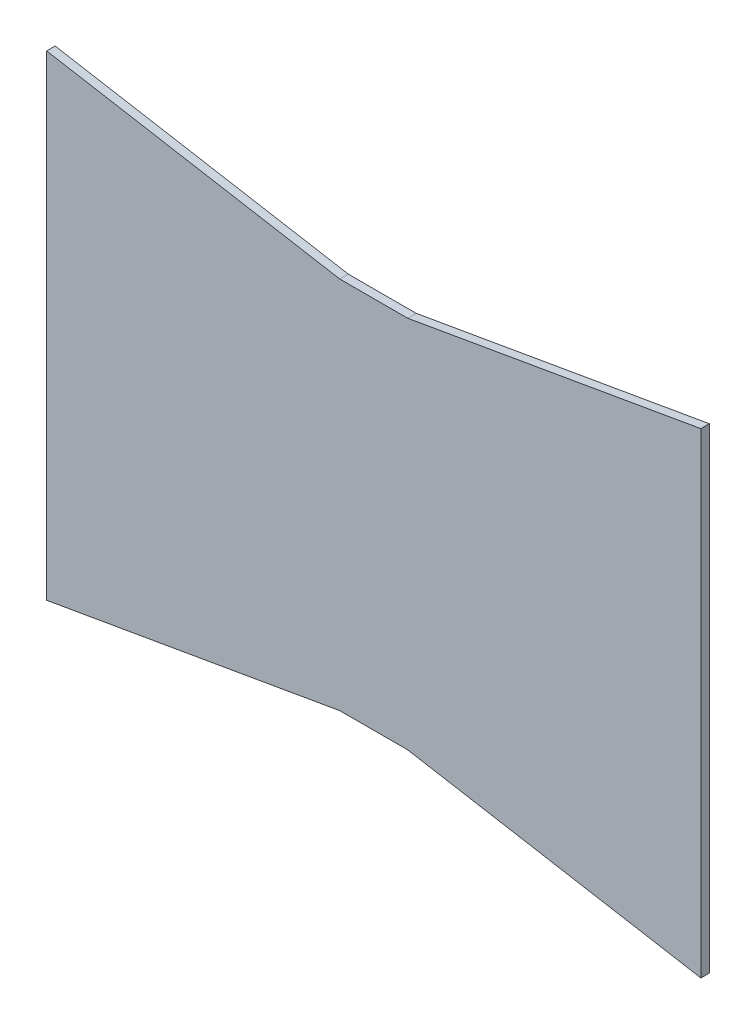
ISO-10303-21;
HEADER;
FILE_DESCRIPTION(('STEP AP214'),'2;1');
FILE_NAME('part.step','',(''),(''),'','','');
FILE_SCHEMA(('AUTOMOTIVE_DESIGN { 1 0 10303 214 1 1 1 1 }'));
ENDSEC;
DATA;
#1=APPLICATION_CONTEXT('core data for automotive mechanical design processes');
#2=APPLICATION_PROTOCOL_DEFINITION('international standard','automotive_design',2000,#1);
#3=PRODUCT_CONTEXT('',#1,'mechanical');
#4=PRODUCT('Part','Part','',(#3));
#5=PRODUCT_RELATED_PRODUCT_CATEGORY('part','',(#4));
#6=PRODUCT_DEFINITION_FORMATION('','',#4);
#7=PRODUCT_DEFINITION_CONTEXT('part definition',#1,'design');
#8=PRODUCT_DEFINITION('design','',#6,#7);
#9=PRODUCT_DEFINITION_SHAPE('','',#8);
#10=(LENGTH_UNIT() NAMED_UNIT(*) SI_UNIT(.MILLI.,.METRE.));
#11=(NAMED_UNIT(*) PLANE_ANGLE_UNIT() SI_UNIT($,.RADIAN.));
#12=(NAMED_UNIT(*) SI_UNIT($,.STERADIAN.) SOLID_ANGLE_UNIT());
#13=UNCERTAINTY_MEASURE_WITH_UNIT(LENGTH_MEASURE(1.E-05),#10,'distance_accuracy_value','');
#14=(GEOMETRIC_REPRESENTATION_CONTEXT(3) GLOBAL_UNCERTAINTY_ASSIGNED_CONTEXT((#13)) GLOBAL_UNIT_ASSIGNED_CONTEXT((#10,
#11,#12)) REPRESENTATION_CONTEXT('',''));
#15=CARTESIAN_POINT('',(0.,0.,0.));
#16=DIRECTION('',(0.,0.,1.));
#17=DIRECTION('',(1.,0.,0.));
#18=AXIS2_PLACEMENT_3D('',#15,#16,#17);
#19=CARTESIAN_POINT('',(22.8366972477065,-131.311009174312,6.35));
#20=DIRECTION('',(0.171341174751248,-0.985211754819674,0.));
#21=DIRECTION('',(0.985211754819675,0.171341174751248,0.));
#22=AXIS2_PLACEMENT_3D('',#19,#20,#21);
#23=PLANE('',#22);
#24=DIRECTION('',(-0.985211754819674,-0.171341174751248,0.));
#25=VECTOR('',#24,1.);
#26=CARTESIAN_POINT('',(22.8366972477065,-131.311009174312,0.));
#27=LINE('',#26,#25);
#28=CARTESIAN_POINT('',(-25.4000000000001,-139.7,0.));
#29=VERTEX_POINT('',#28);
#30=CARTESIAN_POINT('',(-244.475,-177.8,0.));
#31=VERTEX_POINT('',#30);
#32=EDGE_CURVE('E130',#29,#31,#27,.T.);
#33=ORIENTED_EDGE('',*,*,#32,.F.);
#34=DIRECTION('',(0.,0.,-1.));
#35=VECTOR('',#34,1.);
#36=CARTESIAN_POINT('',(-25.4000000000001,-139.7,6.35));
#37=LINE('',#36,#35);
#38=CARTESIAN_POINT('',(-25.4000000000001,-139.7,6.35));
#39=VERTEX_POINT('',#38);
#40=EDGE_CURVE('E11',#39,#29,#37,.T.);
#41=ORIENTED_EDGE('',*,*,#40,.F.);
#42=DIRECTION('',(-0.985211754819674,-0.171341174751248,0.));
#43=VECTOR('',#42,1.);
#44=CARTESIAN_POINT('',(22.8366972477065,-131.311009174312,6.35));
#45=LINE('',#44,#43);
#46=CARTESIAN_POINT('',(-244.475,-177.8,6.35));
#47=VERTEX_POINT('',#46);
#48=EDGE_CURVE('E148',#39,#47,#45,.T.);
#49=ORIENTED_EDGE('',*,*,#48,.T.);
#50=DIRECTION('',(0.,0.,-1.));
#51=VECTOR('',#50,1.);
#52=CARTESIAN_POINT('',(-244.475,-177.8,6.35));
#53=LINE('',#52,#51);
#54=EDGE_CURVE('E85',#47,#31,#53,.T.);
#55=ORIENTED_EDGE('',*,*,#54,.T.);
#56=EDGE_LOOP('',(#33,#41,#49,#55));
#57=FACE_BOUND('',#56,.T.);
#58=ADVANCED_FACE('F35',(#57),#23,.T.);
#59=CARTESIAN_POINT('',(0.,-139.7,6.35));
#60=DIRECTION('',(0.,1.,0.));
#61=DIRECTION('',(0.,0.,1.));
#62=AXIS2_PLACEMENT_3D('',#59,#60,#61);
#63=PLANE('',#62);
#64=DIRECTION('',(1.,0.,0.));
#65=VECTOR('',#64,1.);
#66=CARTESIAN_POINT('',(0.,-139.7,0.));
#67=LINE('',#66,#65);
#68=CARTESIAN_POINT('',(25.3999999999999,-139.7,0.));
#69=VERTEX_POINT('',#68);
#70=EDGE_CURVE('E133',#29,#69,#67,.T.);
#71=ORIENTED_EDGE('',*,*,#70,.T.);
#72=DIRECTION('',(0.,0.,-1.));
#73=VECTOR('',#72,1.);
#74=CARTESIAN_POINT('',(25.3999999999999,-139.7,6.35));
#75=LINE('',#74,#73);
#76=CARTESIAN_POINT('',(25.3999999999999,-139.7,6.35));
#77=VERTEX_POINT('',#76);
#78=EDGE_CURVE('E43',#77,#69,#75,.T.);
#79=ORIENTED_EDGE('',*,*,#78,.F.);
#80=DIRECTION('',(1.,0.,0.));
#81=VECTOR('',#80,1.);
#82=CARTESIAN_POINT('',(0.,-139.7,6.35));
#83=LINE('',#82,#81);
#84=EDGE_CURVE('E172',#39,#77,#83,.T.);
#85=ORIENTED_EDGE('',*,*,#84,.F.);
#86=ORIENTED_EDGE('',*,*,#40,.T.);
#87=EDGE_LOOP('',(#71,#79,#85,#86));
#88=FACE_BOUND('',#87,.T.);
#89=ADVANCED_FACE('F176',(#88),#63,.F.);
#90=CARTESIAN_POINT('',(-22.8366972477064,-131.311009174312,6.35));
#91=DIRECTION('',(0.171341174751248,0.985211754819674,0.));
#92=DIRECTION('',(-0.985211754819675,0.171341174751248,0.));
#93=AXIS2_PLACEMENT_3D('',#90,#91,#92);
#94=PLANE('',#93);
#95=DIRECTION('',(0.985211754819674,-0.171341174751248,0.));
#96=VECTOR('',#95,1.);
#97=CARTESIAN_POINT('',(-22.8366972477064,-131.311009174312,0.));
#98=LINE('',#97,#96);
#99=CARTESIAN_POINT('',(244.475,-177.8,0.));
#100=VERTEX_POINT('',#99);
#101=EDGE_CURVE('E135',#69,#100,#98,.T.);
#102=ORIENTED_EDGE('',*,*,#101,.T.);
#103=DIRECTION('',(0.,0.,-1.));
#104=VECTOR('',#103,1.);
#105=CARTESIAN_POINT('',(244.475,-177.8,6.35));
#106=LINE('',#105,#104);
#107=CARTESIAN_POINT('',(244.475,-177.8,6.35));
#108=VERTEX_POINT('',#107);
#109=EDGE_CURVE('E154',#108,#100,#106,.T.);
#110=ORIENTED_EDGE('',*,*,#109,.F.);
#111=DIRECTION('',(0.985211754819674,-0.171341174751248,0.));
#112=VECTOR('',#111,1.);
#113=CARTESIAN_POINT('',(-22.8366972477064,-131.311009174312,6.35));
#114=LINE('',#113,#112);
#115=EDGE_CURVE('E162',#77,#108,#114,.T.);
#116=ORIENTED_EDGE('',*,*,#115,.F.);
#117=ORIENTED_EDGE('',*,*,#78,.T.);
#118=EDGE_LOOP('',(#102,#110,#116,#117));
#119=FACE_BOUND('',#118,.T.);
#120=ADVANCED_FACE('F160',(#119),#94,.F.);
#121=CARTESIAN_POINT('',(244.475,0.,6.35));
#122=DIRECTION('',(1.,0.,0.));
#123=DIRECTION('',(0.,1.,0.));
#124=AXIS2_PLACEMENT_3D('',#121,#122,#123);
#125=PLANE('',#124);
#126=DIRECTION('',(0.,-1.,0.));
#127=VECTOR('',#126,1.);
#128=CARTESIAN_POINT('',(244.475,0.,0.));
#129=LINE('',#128,#127);
#130=CARTESIAN_POINT('',(244.475,177.8,0.));
#131=VERTEX_POINT('',#130);
#132=EDGE_CURVE('E138',#131,#100,#129,.T.);
#133=ORIENTED_EDGE('',*,*,#132,.F.);
#134=DIRECTION('',(0.,0.,-1.));
#135=VECTOR('',#134,1.);
#136=CARTESIAN_POINT('',(244.475,177.8,6.35));
#137=LINE('',#136,#135);
#138=CARTESIAN_POINT('',(244.475,177.8,6.35));
#139=VERTEX_POINT('',#138);
#140=EDGE_CURVE('E152',#139,#131,#137,.T.);
#141=ORIENTED_EDGE('',*,*,#140,.F.);
#142=DIRECTION('',(0.,-1.,0.));
#143=VECTOR('',#142,1.);
#144=CARTESIAN_POINT('',(244.475,0.,6.35));
#145=LINE('',#144,#143);
#146=EDGE_CURVE('E125',#139,#108,#145,.T.);
#147=ORIENTED_EDGE('',*,*,#146,.T.);
#148=ORIENTED_EDGE('',*,*,#109,.T.);
#149=EDGE_LOOP('',(#133,#141,#147,#148));
#150=FACE_BOUND('',#149,.T.);
#151=ADVANCED_FACE('F170',(#150),#125,.T.);
#152=CARTESIAN_POINT('',(-22.8366972477064,131.311009174312,6.35));
#153=DIRECTION('',(-0.171341174751248,0.985211754819674,0.));
#154=DIRECTION('',(-0.985211754819675,-0.171341174751248,0.));
#155=AXIS2_PLACEMENT_3D('',#152,#153,#154);
#156=PLANE('',#155);
#157=DIRECTION('',(0.985211754819674,0.171341174751248,0.));
#158=VECTOR('',#157,1.);
#159=CARTESIAN_POINT('',(-22.8366972477064,131.311009174312,0.));
#160=LINE('',#159,#158);
#161=CARTESIAN_POINT('',(25.3999999999999,139.7,0.));
#162=VERTEX_POINT('',#161);
#163=EDGE_CURVE('E141',#162,#131,#160,.T.);
#164=ORIENTED_EDGE('',*,*,#163,.F.);
#165=DIRECTION('',(0.,0.,-1.));
#166=VECTOR('',#165,1.);
#167=CARTESIAN_POINT('',(25.3999999999999,139.7,6.35));
#168=LINE('',#167,#166);
#169=CARTESIAN_POINT('',(25.3999999999999,139.7,6.35));
#170=VERTEX_POINT('',#169);
#171=EDGE_CURVE('E113',#170,#162,#168,.T.);
#172=ORIENTED_EDGE('',*,*,#171,.F.);
#173=DIRECTION('',(0.985211754819674,0.171341174751248,0.));
#174=VECTOR('',#173,1.);
#175=CARTESIAN_POINT('',(-22.8366972477064,131.311009174312,6.35));
#176=LINE('',#175,#174);
#177=EDGE_CURVE('E123',#170,#139,#176,.T.);
#178=ORIENTED_EDGE('',*,*,#177,.T.);
#179=ORIENTED_EDGE('',*,*,#140,.T.);
#180=EDGE_LOOP('',(#164,#172,#178,#179));
#181=FACE_BOUND('',#180,.T.);
#182=ADVANCED_FACE('F186',(#181),#156,.T.);
#183=CARTESIAN_POINT('',(0.,139.7,6.35));
#184=DIRECTION('',(0.,1.,0.));
#185=DIRECTION('',(-1.,0.,0.));
#186=AXIS2_PLACEMENT_3D('',#183,#184,#185);
#187=PLANE('',#186);
#188=DIRECTION('',(1.,0.,0.));
#189=VECTOR('',#188,1.);
#190=CARTESIAN_POINT('',(0.,139.7,0.));
#191=LINE('',#190,#189);
#192=CARTESIAN_POINT('',(-25.4000000000001,139.7,0.));
#193=VERTEX_POINT('',#192);
#194=EDGE_CURVE('E112',#193,#162,#191,.T.);
#195=ORIENTED_EDGE('',*,*,#194,.F.);
#196=DIRECTION('',(0.,0.,-1.));
#197=VECTOR('',#196,1.);
#198=CARTESIAN_POINT('',(-25.4000000000001,139.7,6.35));
#199=LINE('',#198,#197);
#200=CARTESIAN_POINT('',(-25.4000000000001,139.7,6.35));
#201=VERTEX_POINT('',#200);
#202=EDGE_CURVE('E106',#201,#193,#199,.T.);
#203=ORIENTED_EDGE('',*,*,#202,.F.);
#204=DIRECTION('',(1.,0.,0.));
#205=VECTOR('',#204,1.);
#206=CARTESIAN_POINT('',(0.,139.7,6.35));
#207=LINE('',#206,#205);
#208=EDGE_CURVE('E110',#201,#170,#207,.T.);
#209=ORIENTED_EDGE('',*,*,#208,.T.);
#210=ORIENTED_EDGE('',*,*,#171,.T.);
#211=EDGE_LOOP('',(#195,#203,#209,#210));
#212=FACE_BOUND('',#211,.T.);
#213=ADVANCED_FACE('F108',(#212),#187,.T.);
#214=CARTESIAN_POINT('',(22.8366972477064,131.311009174312,6.35));
#215=DIRECTION('',(-0.171341174751248,-0.985211754819674,0.));
#216=DIRECTION('',(0.985211754819675,-0.171341174751248,0.));
#217=AXIS2_PLACEMENT_3D('',#214,#215,#216);
#218=PLANE('',#217);
#219=DIRECTION('',(-0.985211754819674,0.171341174751248,0.));
#220=VECTOR('',#219,1.);
#221=CARTESIAN_POINT('',(22.8366972477064,131.311009174312,0.));
#222=LINE('',#221,#220);
#223=CARTESIAN_POINT('',(-244.475,177.8,0.));
#224=VERTEX_POINT('',#223);
#225=EDGE_CURVE('E78',#193,#224,#222,.T.);
#226=ORIENTED_EDGE('',*,*,#225,.T.);
#227=DIRECTION('',(0.,0.,-1.));
#228=VECTOR('',#227,1.);
#229=CARTESIAN_POINT('',(-244.475,177.8,6.35));
#230=LINE('',#229,#228);
#231=CARTESIAN_POINT('',(-244.475,177.8,6.35));
#232=VERTEX_POINT('',#231);
#233=EDGE_CURVE('E114',#232,#224,#230,.T.);
#234=ORIENTED_EDGE('',*,*,#233,.F.);
#235=DIRECTION('',(-0.985211754819674,0.171341174751248,0.));
#236=VECTOR('',#235,1.);
#237=CARTESIAN_POINT('',(22.8366972477064,131.311009174312,6.35));
#238=LINE('',#237,#236);
#239=EDGE_CURVE('E116',#201,#232,#238,.T.);
#240=ORIENTED_EDGE('',*,*,#239,.F.);
#241=ORIENTED_EDGE('',*,*,#202,.T.);
#242=EDGE_LOOP('',(#226,#234,#240,#241));
#243=FACE_BOUND('',#242,.T.);
#244=ADVANCED_FACE('F117',(#243),#218,.F.);
#245=CARTESIAN_POINT('',(-244.475,0.,6.35));
#246=DIRECTION('',(1.,0.,0.));
#247=DIRECTION('',(0.,0.,-1.));
#248=AXIS2_PLACEMENT_3D('',#245,#246,#247);
#249=PLANE('',#248);
#250=DIRECTION('',(0.,-1.,0.));
#251=VECTOR('',#250,1.);
#252=CARTESIAN_POINT('',(-244.475,0.,0.));
#253=LINE('',#252,#251);
#254=EDGE_CURVE('E146',#224,#31,#253,.T.);
#255=ORIENTED_EDGE('',*,*,#254,.T.);
#256=ORIENTED_EDGE('',*,*,#54,.F.);
#257=DIRECTION('',(0.,-1.,0.));
#258=VECTOR('',#257,1.);
#259=CARTESIAN_POINT('',(-244.475,0.,6.35));
#260=LINE('',#259,#258);
#261=EDGE_CURVE('E51',#232,#47,#260,.T.);
#262=ORIENTED_EDGE('',*,*,#261,.F.);
#263=ORIENTED_EDGE('',*,*,#233,.T.);
#264=EDGE_LOOP('',(#255,#256,#262,#263));
#265=FACE_BOUND('',#264,.T.);
#266=ADVANCED_FACE('F194',(#265),#249,.F.);
#267=CARTESIAN_POINT('',(0.,0.,6.35));
#268=DIRECTION('',(0.,0.,1.));
#269=DIRECTION('',(1.,0.,0.));
#270=AXIS2_PLACEMENT_3D('',#267,#268,#269);
#271=PLANE('',#270);
#272=ORIENTED_EDGE('',*,*,#48,.F.);
#273=ORIENTED_EDGE('',*,*,#84,.T.);
#274=ORIENTED_EDGE('',*,*,#115,.T.);
#275=ORIENTED_EDGE('',*,*,#146,.F.);
#276=ORIENTED_EDGE('',*,*,#177,.F.);
#277=ORIENTED_EDGE('',*,*,#208,.F.);
#278=ORIENTED_EDGE('',*,*,#239,.T.);
#279=ORIENTED_EDGE('',*,*,#261,.T.);
#280=EDGE_LOOP('',(#272,#273,#274,#275,#276,#277,#278,#279));
#281=FACE_BOUND('',#280,.T.);
#282=ADVANCED_FACE('F120',(#281),#271,.T.);
#283=CARTESIAN_POINT('',(0.,0.,0.));
#284=DIRECTION('',(0.,0.,1.));
#285=DIRECTION('',(1.,0.,0.));
#286=AXIS2_PLACEMENT_3D('',#283,#284,#285);
#287=PLANE('',#286);
#288=ORIENTED_EDGE('',*,*,#32,.T.);
#289=ORIENTED_EDGE('',*,*,#254,.F.);
#290=ORIENTED_EDGE('',*,*,#225,.F.);
#291=ORIENTED_EDGE('',*,*,#194,.T.);
#292=ORIENTED_EDGE('',*,*,#163,.T.);
#293=ORIENTED_EDGE('',*,*,#132,.T.);
#294=ORIENTED_EDGE('',*,*,#101,.F.);
#295=ORIENTED_EDGE('',*,*,#70,.F.);
#296=EDGE_LOOP('',(#288,#289,#290,#291,#292,#293,#294,#295));
#297=FACE_BOUND('',#296,.T.);
#298=ADVANCED_FACE('F166',(#297),#287,.F.);
#299=CLOSED_SHELL('',(#58,#89,#120,#151,#182,#213,#244,#266,#282,#298));
#300=MANIFOLD_SOLID_BREP('B2',#299);
#301=ADVANCED_BREP_SHAPE_REPRESENTATION('',(#18,#300),#14);
#302=SHAPE_DEFINITION_REPRESENTATION(#9,#301);
ENDSEC;
END-ISO-10303-21;
